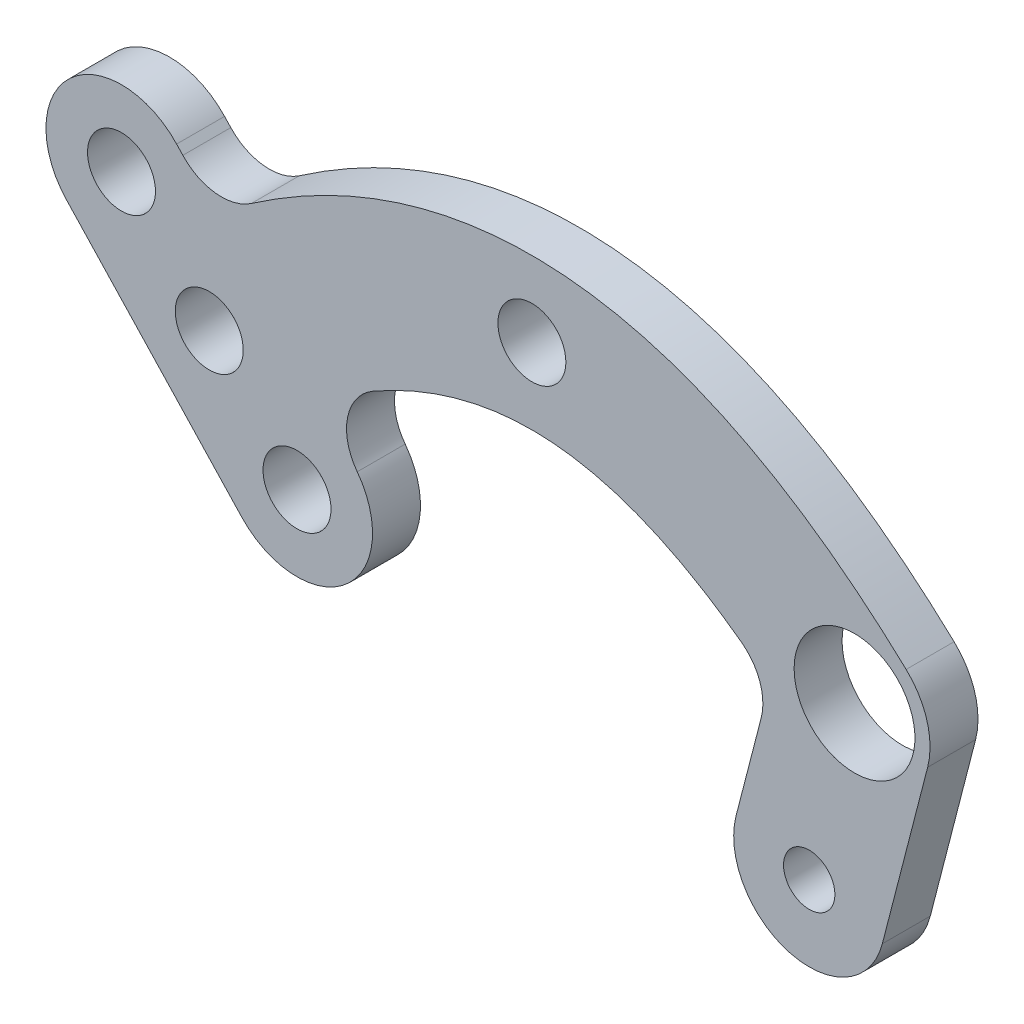
ISO-10303-21;
HEADER;
FILE_DESCRIPTION(('STEP AP214'),'2;1');
FILE_NAME('part.step','',(''),(''),'','','');
FILE_SCHEMA(('AUTOMOTIVE_DESIGN { 1 0 10303 214 1 1 1 1 }'));
ENDSEC;
DATA;
#1=APPLICATION_CONTEXT('core data for automotive mechanical design processes');
#2=APPLICATION_PROTOCOL_DEFINITION('international standard','automotive_design',2000,#1);
#3=PRODUCT_CONTEXT('',#1,'mechanical');
#4=PRODUCT('Part','Part','',(#3));
#5=PRODUCT_RELATED_PRODUCT_CATEGORY('part','',(#4));
#6=PRODUCT_DEFINITION_FORMATION('','',#4);
#7=PRODUCT_DEFINITION_CONTEXT('part definition',#1,'design');
#8=PRODUCT_DEFINITION('design','',#6,#7);
#9=PRODUCT_DEFINITION_SHAPE('','',#8);
#10=(LENGTH_UNIT() NAMED_UNIT(*) SI_UNIT(.MILLI.,.METRE.));
#11=(NAMED_UNIT(*) PLANE_ANGLE_UNIT() SI_UNIT($,.RADIAN.));
#12=(NAMED_UNIT(*) SI_UNIT($,.STERADIAN.) SOLID_ANGLE_UNIT());
#13=UNCERTAINTY_MEASURE_WITH_UNIT(LENGTH_MEASURE(1.E-05),#10,'distance_accuracy_value','');
#14=(GEOMETRIC_REPRESENTATION_CONTEXT(3) GLOBAL_UNCERTAINTY_ASSIGNED_CONTEXT((#13)) GLOBAL_UNIT_ASSIGNED_CONTEXT((#10,
#11,#12)) REPRESENTATION_CONTEXT('',''));
#15=CARTESIAN_POINT('',(0.,0.,0.));
#16=DIRECTION('',(0.,0.,1.));
#17=DIRECTION('',(1.,0.,0.));
#18=AXIS2_PLACEMENT_3D('',#15,#16,#17);
#19=CARTESIAN_POINT('',(-24.7774314290993,-6.35018323372195,1.5875));
#20=CARTESIAN_POINT('',(-24.2998102513977,-5.90297239317743,1.5875));
#21=CARTESIAN_POINT('',(-23.3228949597084,-5.01651392990913,1.5875));
#22=CARTESIAN_POINT('',(-21.3738810598693,-3.36280289341278,1.5875));
#23=CARTESIAN_POINT('',(-18.9018748021789,-1.48063302855797,1.5875));
#24=CARTESIAN_POINT('',(-15.8850966754007,0.462779531041348,1.5875));
#25=CARTESIAN_POINT('',(-11.7850099244528,2.6247446642725,1.5875));
#26=CARTESIAN_POINT('',(-6.5093751368029,4.4880889395126,1.5875));
#27=CARTESIAN_POINT('',(0.,5.2559555302437,1.5875));
#28=CARTESIAN_POINT('',(6.5093751368029,4.4880889395126,1.5875));
#29=CARTESIAN_POINT('',(11.7850099244528,2.62474466427251,1.5875));
#30=CARTESIAN_POINT('',(15.8850966754007,0.462779531041344,1.5875));
#31=CARTESIAN_POINT('',(18.9018748021789,-1.48063302855797,1.5875));
#32=CARTESIAN_POINT('',(21.3738810598693,-3.36280289341278,1.5875));
#33=CARTESIAN_POINT('',(23.3228949597084,-5.01651392990913,1.5875));
#34=CARTESIAN_POINT('',(24.2998102513977,-5.90297239317743,1.5875));
#35=CARTESIAN_POINT('',(24.7774314290993,-6.35018323372195,1.5875));
#36=B_SPLINE_CURVE_WITH_KNOTS('',3,(#19,#20,#21,#22,#23,#24,#25,#26,#27,#28,#29,#30,#31,#32,#33,
#34,#35),.UNSPECIFIED.,.F.,.F.,(4,1,1,1,1,1,1,1,1,1,1,1,1,1,4),(0.,0.03125,0.0625,0.125,0.1875,
0.25,0.375,0.5,0.625,0.75,0.8125,0.875,0.9375,0.96875,1.),.UNSPECIFIED.);
#37=DIRECTION('',(0.,0.,-1.));
#38=VECTOR('',#37,1.);
#39=SURFACE_OF_LINEAR_EXTRUSION('',#36,#38);
#40=CARTESIAN_POINT('',(-24.7774314290993,-6.35018323372195,-1.5875));
#41=CARTESIAN_POINT('',(-24.2998102513977,-5.90297239317743,-1.5875));
#42=CARTESIAN_POINT('',(-23.3228949597084,-5.01651392990913,-1.5875));
#43=CARTESIAN_POINT('',(-21.3738810598693,-3.36280289341278,-1.5875));
#44=CARTESIAN_POINT('',(-18.9018748021789,-1.48063302855797,-1.5875));
#45=CARTESIAN_POINT('',(-15.8850966754007,0.462779531041348,-1.5875));
#46=CARTESIAN_POINT('',(-11.7850099244528,2.6247446642725,-1.5875));
#47=CARTESIAN_POINT('',(-6.5093751368029,4.4880889395126,-1.5875));
#48=CARTESIAN_POINT('',(0.,5.2559555302437,-1.5875));
#49=CARTESIAN_POINT('',(6.5093751368029,4.4880889395126,-1.5875));
#50=CARTESIAN_POINT('',(11.7850099244528,2.62474466427251,-1.5875));
#51=CARTESIAN_POINT('',(15.8850966754007,0.462779531041344,-1.5875));
#52=CARTESIAN_POINT('',(18.9018748021789,-1.48063302855797,-1.5875));
#53=CARTESIAN_POINT('',(21.3738810598693,-3.36280289341278,-1.5875));
#54=CARTESIAN_POINT('',(23.3228949597084,-5.01651392990913,-1.5875));
#55=CARTESIAN_POINT('',(24.2998102513977,-5.90297239317743,-1.5875));
#56=CARTESIAN_POINT('',(24.7774314290993,-6.35018323372195,-1.5875));
#57=B_SPLINE_CURVE_WITH_KNOTS('',3,(#40,#41,#42,#43,#44,#45,#46,#47,#48,#49,#50,#51,#52,#53,#54,
#55,#56),.UNSPECIFIED.,.F.,.F.,(4,1,1,1,1,1,1,1,1,1,1,1,1,1,4),(0.,0.03125,0.0625,0.125,0.1875,
0.25,0.375,0.5,0.625,0.75,0.8125,0.875,0.9375,0.96875,1.),.UNSPECIFIED.);
#58=CARTESIAN_POINT('',(-18.5671163611911,-1.30604349272353,-1.5875));
#59=VERTEX_POINT('',#58);
#60=CARTESIAN_POINT('',(24.7774314290993,-6.35018323372195,-1.5875));
#61=VERTEX_POINT('',#60);
#62=EDGE_CURVE('E411',#59,#61,#57,.T.);
#63=ORIENTED_EDGE('',*,*,#62,.F.);
#64=DIRECTION('',(0.,0.,-1.));
#65=VECTOR('',#64,1.);
#66=CARTESIAN_POINT('',(-18.5671163611911,-1.30604349272352,-1.5875));
#67=LINE('',#66,#65);
#68=CARTESIAN_POINT('',(-18.5671163611911,-1.30604349272353,1.5875));
#69=VERTEX_POINT('',#68);
#70=EDGE_CURVE('E457',#59,#69,#67,.F.);
#71=ORIENTED_EDGE('',*,*,#70,.T.);
#72=CARTESIAN_POINT('',(24.7774314290993,-6.35018323372195,1.5875));
#73=VERTEX_POINT('',#72);
#74=EDGE_CURVE('E330',#69,#73,#36,.T.);
#75=ORIENTED_EDGE('',*,*,#74,.T.);
#76=DIRECTION('',(0.,0.,-1.));
#77=VECTOR('',#76,1.);
#78=CARTESIAN_POINT('',(24.7774314290993,-6.35018323372195,1.5875));
#79=LINE('',#78,#77);
#80=EDGE_CURVE('E406',#73,#61,#79,.T.);
#81=ORIENTED_EDGE('',*,*,#80,.T.);
#82=EDGE_LOOP('',(#63,#71,#75,#81));
#83=FACE_BOUND('',#82,.T.);
#84=ADVANCED_FACE('F177',(#83),#39,.T.);
#85=CARTESIAN_POINT('',(0.,0.,-1.5875));
#86=DIRECTION('',(0.,0.,1.));
#87=DIRECTION('',(1.,0.,0.));
#88=AXIS2_PLACEMENT_3D('',#85,#86,#87);
#89=PLANE('',#88);
#90=CARTESIAN_POINT('',(21.36,-10.,-1.5875));
#91=DIRECTION('',(0.,0.,-1.));
#92=DIRECTION('',(-1.,0.,0.));
#93=AXIS2_PLACEMENT_3D('',#90,#91,#92);
#94=CIRCLE('',#93,4.);
#95=CARTESIAN_POINT('',(17.36,-10.,-1.5875));
#96=VERTEX_POINT('',#95);
#97=EDGE_CURVE('E492',#96,#96,#94,.T.);
#98=ORIENTED_EDGE('',*,*,#97,.F.);
#99=EDGE_LOOP('',(#98));
#100=FACE_BOUND('',#99,.T.);
#101=CARTESIAN_POINT('',(18.36,-21.6189500386222,-1.5875));
#102=DIRECTION('',(0.,0.,-1.));
#103=DIRECTION('',(-1.,0.,0.));
#104=AXIS2_PLACEMENT_3D('',#101,#102,#103);
#105=CIRCLE('',#104,1.7);
#106=CARTESIAN_POINT('',(16.66,-21.6189500386222,-1.5875));
#107=VERTEX_POINT('',#106);
#108=EDGE_CURVE('E488',#107,#107,#105,.T.);
#109=ORIENTED_EDGE('',*,*,#108,.F.);
#110=EDGE_LOOP('',(#109));
#111=FACE_BOUND('',#110,.T.);
#112=DIRECTION('',(0.25,0.968245836551854,0.));
#113=VECTOR('',#112,1.);
#114=CARTESIAN_POINT('',(17.6043854086204,-4.5454327671869,-1.5875));
#115=LINE('',#114,#113);
#116=CARTESIAN_POINT('',(13.5187708172407,-20.3689500386223,-1.5875));
#117=VERTEX_POINT('',#116);
#118=CARTESIAN_POINT('',(15.181366688933,-13.9297439160849,-1.5875));
#119=VERTEX_POINT('',#118);
#120=EDGE_CURVE('E290',#117,#119,#115,.T.);
#121=ORIENTED_EDGE('',*,*,#120,.T.);
#122=CARTESIAN_POINT('',(11.7925062610015,-13.0547439160849,-1.5875));
#123=DIRECTION('',(0.,0.,1.));
#124=DIRECTION('',(1.,0.,0.));
#125=AXIS2_PLACEMENT_3D('',#122,#123,#124);
#126=CIRCLE('',#125,3.5);
#127=CARTESIAN_POINT('',(13.8714595418848,-10.239081781541,-1.5875));
#128=VERTEX_POINT('',#127);
#129=EDGE_CURVE('E185',#119,#128,#126,.T.);
#130=ORIENTED_EDGE('',*,*,#129,.T.);
#131=CARTESIAN_POINT('',(-17.9425685709007,-13.649816766278,-1.5875));
#132=CARTESIAN_POINT('',(-17.5430726857818,-13.275756948751,-1.5875));
#133=CARTESIAN_POINT('',(-16.7212792004638,-12.5301144959242,-1.5875));
#134=CARTESIAN_POINT('',(-15.1194822649109,-11.1715962935639,-1.5875));
#135=CARTESIAN_POINT('',(-13.1369844739387,-9.66413215948502,-1.5875));
#136=CARTESIAN_POINT('',(-10.8152020856161,-8.17139279210594,-1.5875));
#137=CARTESIAN_POINT('',(-7.79481806162839,-6.58291593418248,-1.5875));
#138=CARTESIAN_POINT('',(-4.17067918338198,-5.32148120499988,-1.5875));
#139=CARTESIAN_POINT('',(0.,-4.83925939750006,-1.5875));
#140=CARTESIAN_POINT('',(4.17067918338198,-5.32148120499988,-1.5875));
#141=CARTESIAN_POINT('',(7.79481806162839,-6.58291593418248,-1.5875));
#142=CARTESIAN_POINT('',(10.8152020856161,-8.17139279210594,-1.5875));
#143=CARTESIAN_POINT('',(13.1369844739387,-9.66413215948502,-1.5875));
#144=CARTESIAN_POINT('',(15.1194822649109,-11.1715962935639,-1.5875));
#145=CARTESIAN_POINT('',(16.7212792004638,-12.5301144959242,-1.5875));
#146=CARTESIAN_POINT('',(17.5430726857818,-13.275756948751,-1.5875));
#147=CARTESIAN_POINT('',(17.9425685709007,-13.649816766278,-1.5875));
#148=B_SPLINE_CURVE_WITH_KNOTS('',3,(#131,#132,#133,#134,#135,#136,#137,#138,#139,#140,#141,
#142,#143,#144,#145,#146,#147),.UNSPECIFIED.,.F.,.F.,(4,1,1,1,1,1,1,1,1,1,1,1,1,1,4),(0.,
0.03125,0.0625,0.125,0.1875,0.25,0.375,0.5,0.625,0.75,0.8125,0.875,0.9375,0.96875,1.),.UNSPECIFIED.);
#149=CARTESIAN_POINT('',(-10.5009094068875,-8.03488231582913,-1.5875));
#150=VERTEX_POINT('',#149);
#151=EDGE_CURVE('E415',#150,#128,#148,.T.);
#152=ORIENTED_EDGE('',*,*,#151,.F.);
#153=CARTESIAN_POINT('',(-8.77089976969667,-11.0774251101423,-1.5875));
#154=DIRECTION('',(0.,0.,1.));
#155=DIRECTION('',(1.,0.,0.));
#156=AXIS2_PLACEMENT_3D('',#153,#154,#155);
#157=CIRCLE('',#156,3.5);
#158=CARTESIAN_POINT('',(-11.5624449229815,-13.1886512129489,-1.5875));
#159=VERTEX_POINT('',#158);
#160=EDGE_CURVE('E472',#150,#159,#157,.T.);
#161=ORIENTED_EDGE('',*,*,#160,.T.);
#162=CARTESIAN_POINT('',(-15.5503665705312,-16.2046885026727,-1.5875));
#163=DIRECTION('',(0.,0.,-1.));
#164=DIRECTION('',(-1.,0.,0.));
#165=AXIS2_PLACEMENT_3D('',#162,#163,#164);
#166=CIRCLE('',#165,5.);
#167=CARTESIAN_POINT('',(-19.2001833368092,-19.622119931772,-1.5875));
#168=VERTEX_POINT('',#167);
#169=EDGE_CURVE('E329',#159,#168,#166,.T.);
#170=ORIENTED_EDGE('',*,*,#169,.T.);
#171=DIRECTION('',(-0.68348628581986,0.729963353255608,0.));
#172=VECTOR('',#171,1.);
#173=CARTESIAN_POINT('',(-28.4272481953773,-9.76761466282125,-1.5875));
#174=LINE('',#173,#172);
#175=CARTESIAN_POINT('',(-30.8194501957469,-7.21274292642662,-1.5875));
#176=VERTEX_POINT('',#175);
#177=EDGE_CURVE('E442',#168,#176,#174,.T.);
#178=ORIENTED_EDGE('',*,*,#177,.T.);
#179=CARTESIAN_POINT('',(-27.1696334294688,-3.79531149732732,-1.5875));
#180=DIRECTION('',(0.,0.,1.));
#181=DIRECTION('',(1.,0.,0.));
#182=AXIS2_PLACEMENT_3D('',#179,#180,#181);
#183=CIRCLE('',#182,5.);
#184=CARTESIAN_POINT('',(-23.5198166631908,-0.377880068228026,-1.5875));
#185=VERTEX_POINT('',#184);
#186=EDGE_CURVE('E444',#185,#176,#183,.T.);
#187=ORIENTED_EDGE('',*,*,#186,.F.);
#188=DIRECTION('',(-0.683486285819859,0.729963353255609,0.));
#189=VECTOR('',#188,1.);
#190=CARTESIAN_POINT('',(-21.1276146628213,-2.93275180462266,-1.5875));
#191=LINE('',#190,#189);
#192=CARTESIAN_POINT('',(-23.1088113192402,-0.816833775567268,-1.5875));
#193=VERTEX_POINT('',#192);
#194=EDGE_CURVE('E432',#193,#185,#191,.T.);
#195=ORIENTED_EDGE('',*,*,#194,.F.);
#196=CARTESIAN_POINT('',(-20.5539395828455,1.57536822480223,-1.5875));
#197=DIRECTION('',(0.,0.,1.));
#198=DIRECTION('',(1.,0.,0.));
#199=AXIS2_PLACEMENT_3D('',#196,#197,#198);
#200=CIRCLE('',#199,3.5);
#201=EDGE_CURVE('E468',#193,#59,#200,.T.);
#202=ORIENTED_EDGE('',*,*,#201,.T.);
#203=ORIENTED_EDGE('',*,*,#62,.T.);
#204=CARTESIAN_POINT('',(21.36,-10.,-1.5875));
#205=DIRECTION('',(0.,0.,1.));
#206=DIRECTION('',(1.,0.,0.));
#207=AXIS2_PLACEMENT_3D('',#204,#205,#206);
#208=CIRCLE('',#207,5.);
#209=CARTESIAN_POINT('',(26.2012291827593,-11.25,-1.5875));
#210=VERTEX_POINT('',#209);
#211=EDGE_CURVE('E336',#210,#61,#208,.T.);
#212=ORIENTED_EDGE('',*,*,#211,.F.);
#213=DIRECTION('',(0.25,0.968245836551854,0.));
#214=VECTOR('',#213,1.);
#215=CARTESIAN_POINT('',(27.2868437741389,-7.0454327671869,-1.5875));
#216=LINE('',#215,#214);
#217=CARTESIAN_POINT('',(23.2012291827593,-22.8689500386223,-1.5875));
#218=VERTEX_POINT('',#217);
#219=EDGE_CURVE('E281',#218,#210,#216,.T.);
#220=ORIENTED_EDGE('',*,*,#219,.F.);
#221=CARTESIAN_POINT('',(18.36,-21.6189500386222,-1.5875));
#222=DIRECTION('',(0.,0.,-1.));
#223=DIRECTION('',(-1.,0.,0.));
#224=AXIS2_PLACEMENT_3D('',#221,#222,#223);
#225=CIRCLE('',#224,5.);
#226=EDGE_CURVE('E278',#117,#218,#225,.F.);
#227=ORIENTED_EDGE('',*,*,#226,.F.);
#228=EDGE_LOOP('',(#121,#130,#152,#161,#170,#178,#187,#195,#202,#203,#212,#220,#227));
#229=FACE_BOUND('',#228,.T.);
#230=CARTESIAN_POINT('',(-21.3599999993473,-9.99999999938886,-1.5875));
#231=DIRECTION('',(0.,0.,1.));
#232=DIRECTION('',(1.,0.,0.));
#233=AXIS2_PLACEMENT_3D('',#230,#231,#232);
#234=CIRCLE('',#233,2.25);
#235=CARTESIAN_POINT('',(-19.1099999993473,-9.99999999938886,-1.5875));
#236=VERTEX_POINT('',#235);
#237=EDGE_CURVE('E299',#236,#236,#234,.T.);
#238=ORIENTED_EDGE('',*,*,#237,.T.);
#239=EDGE_LOOP('',(#238));
#240=FACE_BOUND('',#239,.T.);
#241=CARTESIAN_POINT('',(0.,0.,-1.5875));
#242=DIRECTION('',(0.,0.,1.));
#243=DIRECTION('',(1.,0.,0.));
#244=AXIS2_PLACEMENT_3D('',#241,#242,#243);
#245=CIRCLE('',#244,2.25);
#246=CARTESIAN_POINT('',(2.25,0.,-1.5875));
#247=VERTEX_POINT('',#246);
#248=EDGE_CURVE('E314',#247,#247,#245,.T.);
#249=ORIENTED_EDGE('',*,*,#248,.T.);
#250=EDGE_LOOP('',(#249));
#251=FACE_BOUND('',#250,.T.);
#252=CARTESIAN_POINT('',(-15.5503665705312,-16.2046885026727,-1.5875));
#253=DIRECTION('',(0.,0.,1.));
#254=DIRECTION('',(1.,0.,0.));
#255=AXIS2_PLACEMENT_3D('',#252,#253,#254);
#256=CIRCLE('',#255,2.25);
#257=CARTESIAN_POINT('',(-13.3003665705312,-16.2046885026727,-1.5875));
#258=VERTEX_POINT('',#257);
#259=EDGE_CURVE('E320',#258,#258,#256,.T.);
#260=ORIENTED_EDGE('',*,*,#259,.T.);
#261=EDGE_LOOP('',(#260));
#262=FACE_BOUND('',#261,.T.);
#263=CARTESIAN_POINT('',(-27.1696334294688,-3.79531149732732,-1.5875));
#264=DIRECTION('',(0.,0.,1.));
#265=DIRECTION('',(1.,0.,0.));
#266=AXIS2_PLACEMENT_3D('',#263,#264,#265);
#267=CIRCLE('',#266,2.25);
#268=CARTESIAN_POINT('',(-24.9196334294688,-3.79531149732732,-1.5875));
#269=VERTEX_POINT('',#268);
#270=EDGE_CURVE('E326',#269,#269,#267,.T.);
#271=ORIENTED_EDGE('',*,*,#270,.T.);
#272=EDGE_LOOP('',(#271));
#273=FACE_BOUND('',#272,.T.);
#274=ADVANCED_FACE('F348',(#100,#111,#229,#240,#251,#262,#273),#89,.F.);
#275=CARTESIAN_POINT('',(-17.9425685709007,-13.649816766278,1.5875));
#276=CARTESIAN_POINT('',(-17.5430726857818,-13.275756948751,1.5875));
#277=CARTESIAN_POINT('',(-16.7212792004638,-12.5301144959242,1.5875));
#278=CARTESIAN_POINT('',(-15.1194822649109,-11.1715962935639,1.5875));
#279=CARTESIAN_POINT('',(-13.1369844739387,-9.66413215948502,1.5875));
#280=CARTESIAN_POINT('',(-10.8152020856161,-8.17139279210594,1.5875));
#281=CARTESIAN_POINT('',(-7.79481806162839,-6.58291593418248,1.5875));
#282=CARTESIAN_POINT('',(-4.17067918338198,-5.32148120499988,1.5875));
#283=CARTESIAN_POINT('',(0.,-4.83925939750006,1.5875));
#284=CARTESIAN_POINT('',(4.17067918338198,-5.32148120499988,1.5875));
#285=CARTESIAN_POINT('',(7.79481806162839,-6.58291593418248,1.5875));
#286=CARTESIAN_POINT('',(10.8152020856161,-8.17139279210594,1.5875));
#287=CARTESIAN_POINT('',(13.1369844739387,-9.66413215948502,1.5875));
#288=CARTESIAN_POINT('',(15.1194822649109,-11.1715962935639,1.5875));
#289=CARTESIAN_POINT('',(16.7212792004638,-12.5301144959242,1.5875));
#290=CARTESIAN_POINT('',(17.5430726857818,-13.275756948751,1.5875));
#291=CARTESIAN_POINT('',(17.9425685709007,-13.649816766278,1.5875));
#292=B_SPLINE_CURVE_WITH_KNOTS('',3,(#275,#276,#277,#278,#279,#280,#281,#282,#283,#284,#285,
#286,#287,#288,#289,#290,#291),.UNSPECIFIED.,.F.,.F.,(4,1,1,1,1,1,1,1,1,1,1,1,1,1,4),(0.,
0.03125,0.0625,0.125,0.1875,0.25,0.375,0.5,0.625,0.75,0.8125,0.875,0.9375,0.96875,1.),.UNSPECIFIED.);
#293=DIRECTION('',(0.,0.,-1.));
#294=VECTOR('',#293,1.);
#295=SURFACE_OF_LINEAR_EXTRUSION('',#292,#294);
#296=CARTESIAN_POINT('',(-10.5009094068875,-8.03488231582913,1.5875));
#297=VERTEX_POINT('',#296);
#298=CARTESIAN_POINT('',(13.8714595418848,-10.239081781541,1.5875));
#299=VERTEX_POINT('',#298);
#300=EDGE_CURVE('E335',#297,#299,#292,.T.);
#301=ORIENTED_EDGE('',*,*,#300,.F.);
#302=DIRECTION('',(0.,0.,-1.));
#303=VECTOR('',#302,1.);
#304=CARTESIAN_POINT('',(-10.5009094068875,-8.03488231582913,1.5875));
#305=LINE('',#304,#303);
#306=EDGE_CURVE('E461',#297,#150,#305,.T.);
#307=ORIENTED_EDGE('',*,*,#306,.T.);
#308=ORIENTED_EDGE('',*,*,#151,.T.);
#309=DIRECTION('',(0.,0.,-1.));
#310=VECTOR('',#309,1.);
#311=CARTESIAN_POINT('',(13.8714595418848,-10.239081781541,-1.5875));
#312=LINE('',#311,#310);
#313=EDGE_CURVE('E459',#128,#299,#312,.F.);
#314=ORIENTED_EDGE('',*,*,#313,.T.);
#315=EDGE_LOOP('',(#301,#307,#308,#314));
#316=FACE_BOUND('',#315,.T.);
#317=ADVANCED_FACE('F350',(#316),#295,.F.);
#318=CARTESIAN_POINT('',(21.36,-10.,1.5875));
#319=DIRECTION('',(0.,0.,-1.));
#320=DIRECTION('',(-1.,0.,0.));
#321=AXIS2_PLACEMENT_3D('',#318,#319,#320);
#322=CYLINDRICAL_SURFACE('',#321,5.);
#323=CARTESIAN_POINT('',(21.36,-10.,1.5875));
#324=DIRECTION('',(0.,0.,1.));
#325=DIRECTION('',(1.,0.,0.));
#326=AXIS2_PLACEMENT_3D('',#323,#324,#325);
#327=CIRCLE('',#326,5.);
#328=CARTESIAN_POINT('',(26.2012291827593,-11.25,1.5875));
#329=VERTEX_POINT('',#328);
#330=EDGE_CURVE('E402',#329,#73,#327,.T.);
#331=ORIENTED_EDGE('',*,*,#330,.F.);
#332=DIRECTION('',(0.,0.,-1.));
#333=VECTOR('',#332,1.);
#334=CARTESIAN_POINT('',(26.2012291827593,-11.25,21.6150258635163));
#335=LINE('',#334,#333);
#336=EDGE_CURVE('E287',#329,#210,#335,.T.);
#337=ORIENTED_EDGE('',*,*,#336,.T.);
#338=ORIENTED_EDGE('',*,*,#211,.T.);
#339=ORIENTED_EDGE('',*,*,#80,.F.);
#340=EDGE_LOOP('',(#331,#337,#338,#339));
#341=FACE_BOUND('',#340,.T.);
#342=ADVANCED_FACE('F358',(#341),#322,.T.);
#343=CARTESIAN_POINT('',(0.,0.,1.5875));
#344=DIRECTION('',(0.,0.,1.));
#345=DIRECTION('',(1.,0.,0.));
#346=AXIS2_PLACEMENT_3D('',#343,#344,#345);
#347=PLANE('',#346);
#348=CARTESIAN_POINT('',(21.36,-10.,1.5875));
#349=DIRECTION('',(0.,0.,-1.));
#350=DIRECTION('',(-1.,0.,0.));
#351=AXIS2_PLACEMENT_3D('',#348,#349,#350);
#352=CIRCLE('',#351,4.);
#353=CARTESIAN_POINT('',(17.36,-10.,1.5875));
#354=VERTEX_POINT('',#353);
#355=EDGE_CURVE('E491',#354,#354,#352,.T.);
#356=ORIENTED_EDGE('',*,*,#355,.T.);
#357=EDGE_LOOP('',(#356));
#358=FACE_BOUND('',#357,.T.);
#359=CARTESIAN_POINT('',(18.36,-21.6189500386222,1.5875));
#360=DIRECTION('',(0.,0.,-1.));
#361=DIRECTION('',(-1.,0.,0.));
#362=AXIS2_PLACEMENT_3D('',#359,#360,#361);
#363=CIRCLE('',#362,1.7);
#364=CARTESIAN_POINT('',(16.66,-21.6189500386222,1.5875));
#365=VERTEX_POINT('',#364);
#366=EDGE_CURVE('E307',#365,#365,#363,.T.);
#367=ORIENTED_EDGE('',*,*,#366,.T.);
#368=EDGE_LOOP('',(#367));
#369=FACE_BOUND('',#368,.T.);
#370=CARTESIAN_POINT('',(-15.5503665705312,-16.2046885026727,1.5875));
#371=DIRECTION('',(0.,0.,-1.));
#372=DIRECTION('',(-1.,0.,0.));
#373=AXIS2_PLACEMENT_3D('',#370,#371,#372);
#374=CIRCLE('',#373,5.);
#375=CARTESIAN_POINT('',(-11.5624449229815,-13.1886512129489,1.5875));
#376=VERTEX_POINT('',#375);
#377=CARTESIAN_POINT('',(-19.2001833368092,-19.622119931772,1.5875));
#378=VERTEX_POINT('',#377);
#379=EDGE_CURVE('E431',#376,#378,#374,.T.);
#380=ORIENTED_EDGE('',*,*,#379,.F.);
#381=CARTESIAN_POINT('',(-8.77089976969667,-11.0774251101423,1.5875));
#382=DIRECTION('',(0.,0.,1.));
#383=DIRECTION('',(1.,0.,0.));
#384=AXIS2_PLACEMENT_3D('',#381,#382,#383);
#385=CIRCLE('',#384,3.5);
#386=EDGE_CURVE('E474',#376,#297,#385,.F.);
#387=ORIENTED_EDGE('',*,*,#386,.T.);
#388=ORIENTED_EDGE('',*,*,#300,.T.);
#389=CARTESIAN_POINT('',(11.7925062610015,-13.0547439160849,1.5875));
#390=DIRECTION('',(0.,0.,1.));
#391=DIRECTION('',(1.,0.,0.));
#392=AXIS2_PLACEMENT_3D('',#389,#390,#391);
#393=CIRCLE('',#392,3.5);
#394=CARTESIAN_POINT('',(15.181366688933,-13.9297439160849,1.5875));
#395=VERTEX_POINT('',#394);
#396=EDGE_CURVE('E12',#299,#395,#393,.F.);
#397=ORIENTED_EDGE('',*,*,#396,.T.);
#398=DIRECTION('',(0.25,0.968245836551854,0.));
#399=VECTOR('',#398,1.);
#400=CARTESIAN_POINT('',(17.6043854086204,-4.5454327671869,1.5875));
#401=LINE('',#400,#399);
#402=CARTESIAN_POINT('',(13.5187708172407,-20.3689500386223,1.5875));
#403=VERTEX_POINT('',#402);
#404=EDGE_CURVE('E295',#403,#395,#401,.T.);
#405=ORIENTED_EDGE('',*,*,#404,.F.);
#406=CARTESIAN_POINT('',(18.36,-21.6189500386222,1.5875));
#407=DIRECTION('',(0.,0.,1.));
#408=DIRECTION('',(1.,0.,0.));
#409=AXIS2_PLACEMENT_3D('',#406,#407,#408);
#410=CIRCLE('',#409,5.);
#411=CARTESIAN_POINT('',(23.2012291827593,-22.8689500386223,1.5875));
#412=VERTEX_POINT('',#411);
#413=EDGE_CURVE('E275',#403,#412,#410,.T.);
#414=ORIENTED_EDGE('',*,*,#413,.T.);
#415=DIRECTION('',(0.25,0.968245836551854,0.));
#416=VECTOR('',#415,1.);
#417=CARTESIAN_POINT('',(27.2868437741389,-7.0454327671869,1.5875));
#418=LINE('',#417,#416);
#419=EDGE_CURVE('E284',#412,#329,#418,.T.);
#420=ORIENTED_EDGE('',*,*,#419,.T.);
#421=ORIENTED_EDGE('',*,*,#330,.T.);
#422=ORIENTED_EDGE('',*,*,#74,.F.);
#423=CARTESIAN_POINT('',(-20.5539395828455,1.57536822480223,1.5875));
#424=DIRECTION('',(0.,0.,1.));
#425=DIRECTION('',(1.,0.,0.));
#426=AXIS2_PLACEMENT_3D('',#423,#424,#425);
#427=CIRCLE('',#426,3.5);
#428=CARTESIAN_POINT('',(-23.1088113192402,-0.816833775567268,1.5875));
#429=VERTEX_POINT('',#428);
#430=EDGE_CURVE('E470',#69,#429,#427,.F.);
#431=ORIENTED_EDGE('',*,*,#430,.T.);
#432=DIRECTION('',(0.68348628581986,-0.729963353255609,0.));
#433=VECTOR('',#432,1.);
#434=CARTESIAN_POINT('',(-21.1276146628213,-2.93275180462266,1.5875));
#435=LINE('',#434,#433);
#436=CARTESIAN_POINT('',(-23.5198166631908,-0.377880068228026,1.5875));
#437=VERTEX_POINT('',#436);
#438=EDGE_CURVE('E428',#437,#429,#435,.T.);
#439=ORIENTED_EDGE('',*,*,#438,.F.);
#440=CARTESIAN_POINT('',(-27.1696334294688,-3.79531149732732,1.5875));
#441=DIRECTION('',(0.,0.,1.));
#442=DIRECTION('',(1.,0.,0.));
#443=AXIS2_PLACEMENT_3D('',#440,#441,#442);
#444=CIRCLE('',#443,5.);
#445=CARTESIAN_POINT('',(-30.8194501957469,-7.21274292642662,1.5875));
#446=VERTEX_POINT('',#445);
#447=EDGE_CURVE('E437',#437,#446,#444,.T.);
#448=ORIENTED_EDGE('',*,*,#447,.T.);
#449=DIRECTION('',(0.68348628581986,-0.729963353255609,0.));
#450=VECTOR('',#449,1.);
#451=CARTESIAN_POINT('',(-21.5923853371787,-17.0672481953773,1.5875));
#452=LINE('',#451,#450);
#453=EDGE_CURVE('E434',#446,#378,#452,.T.);
#454=ORIENTED_EDGE('',*,*,#453,.T.);
#455=EDGE_LOOP('',(#380,#387,#388,#397,#405,#414,#420,#421,#422,#431,#439,#448,#454));
#456=FACE_BOUND('',#455,.T.);
#457=CARTESIAN_POINT('',(-21.3599999993473,-9.99999999938886,1.5875));
#458=DIRECTION('',(0.,0.,1.));
#459=DIRECTION('',(1.,0.,0.));
#460=AXIS2_PLACEMENT_3D('',#457,#458,#459);
#461=CIRCLE('',#460,2.24999999999999);
#462=CARTESIAN_POINT('',(-19.1099999993473,-9.99999999938886,1.5875));
#463=VERTEX_POINT('',#462);
#464=EDGE_CURVE('E296',#463,#463,#461,.T.);
#465=ORIENTED_EDGE('',*,*,#464,.F.);
#466=EDGE_LOOP('',(#465));
#467=FACE_BOUND('',#466,.T.);
#468=CARTESIAN_POINT('',(0.,0.,1.5875));
#469=DIRECTION('',(0.,0.,1.));
#470=DIRECTION('',(1.,0.,0.));
#471=AXIS2_PLACEMENT_3D('',#468,#469,#470);
#472=CIRCLE('',#471,2.24999999999999);
#473=CARTESIAN_POINT('',(2.24999999999999,0.,1.5875));
#474=VERTEX_POINT('',#473);
#475=EDGE_CURVE('E311',#474,#474,#472,.T.);
#476=ORIENTED_EDGE('',*,*,#475,.F.);
#477=EDGE_LOOP('',(#476));
#478=FACE_BOUND('',#477,.T.);
#479=CARTESIAN_POINT('',(-15.5503665705312,-16.2046885026727,1.5875));
#480=DIRECTION('',(0.,0.,1.));
#481=DIRECTION('',(1.,0.,0.));
#482=AXIS2_PLACEMENT_3D('',#479,#480,#481);
#483=CIRCLE('',#482,2.24999999999999);
#484=CARTESIAN_POINT('',(-13.3003665705312,-16.2046885026727,1.5875));
#485=VERTEX_POINT('',#484);
#486=EDGE_CURVE('E317',#485,#485,#483,.T.);
#487=ORIENTED_EDGE('',*,*,#486,.F.);
#488=EDGE_LOOP('',(#487));
#489=FACE_BOUND('',#488,.T.);
#490=CARTESIAN_POINT('',(-27.1696334294688,-3.79531149732732,1.5875));
#491=DIRECTION('',(0.,0.,1.));
#492=DIRECTION('',(1.,0.,0.));
#493=AXIS2_PLACEMENT_3D('',#490,#491,#492);
#494=CIRCLE('',#493,2.24999999999999);
#495=CARTESIAN_POINT('',(-24.9196334294688,-3.79531149732732,1.5875));
#496=VERTEX_POINT('',#495);
#497=EDGE_CURVE('E323',#496,#496,#494,.T.);
#498=ORIENTED_EDGE('',*,*,#497,.F.);
#499=EDGE_LOOP('',(#498));
#500=FACE_BOUND('',#499,.T.);
#501=ADVANCED_FACE('F293',(#358,#369,#456,#467,#478,#489,#500),#347,.T.);
#502=CARTESIAN_POINT('',(-28.4272481953773,-9.76761466282125,1.5875));
#503=DIRECTION('',(-0.729963353255608,-0.68348628581986,0.));
#504=DIRECTION('',(0.68348628581986,-0.729963353255608,0.));
#505=AXIS2_PLACEMENT_3D('',#502,#503,#504);
#506=PLANE('',#505);
#507=DIRECTION('',(0.,0.,-1.));
#508=VECTOR('',#507,1.);
#509=CARTESIAN_POINT('',(-30.8194501957469,-7.21274292642662,1.5875));
#510=LINE('',#509,#508);
#511=EDGE_CURVE('E450',#446,#176,#510,.T.);
#512=ORIENTED_EDGE('',*,*,#511,.T.);
#513=ORIENTED_EDGE('',*,*,#177,.F.);
#514=DIRECTION('',(0.,0.,-1.));
#515=VECTOR('',#514,1.);
#516=CARTESIAN_POINT('',(-19.2001833368092,-19.622119931772,1.5875));
#517=LINE('',#516,#515);
#518=EDGE_CURVE('E440',#378,#168,#517,.T.);
#519=ORIENTED_EDGE('',*,*,#518,.F.);
#520=ORIENTED_EDGE('',*,*,#453,.F.);
#521=EDGE_LOOP('',(#512,#513,#519,#520));
#522=FACE_BOUND('',#521,.T.);
#523=ADVANCED_FACE('F362',(#522),#506,.T.);
#524=CARTESIAN_POINT('',(-27.1696334294688,-3.79531149732732,1.5875));
#525=DIRECTION('',(0.,0.,-1.));
#526=DIRECTION('',(-1.,0.,0.));
#527=AXIS2_PLACEMENT_3D('',#524,#525,#526);
#528=CYLINDRICAL_SURFACE('',#527,5.);
#529=ORIENTED_EDGE('',*,*,#186,.T.);
#530=ORIENTED_EDGE('',*,*,#511,.F.);
#531=ORIENTED_EDGE('',*,*,#447,.F.);
#532=DIRECTION('',(0.,0.,-1.));
#533=VECTOR('',#532,1.);
#534=CARTESIAN_POINT('',(-23.5198166631908,-0.377880068228026,1.5875));
#535=LINE('',#534,#533);
#536=EDGE_CURVE('E416',#437,#185,#535,.T.);
#537=ORIENTED_EDGE('',*,*,#536,.T.);
#538=EDGE_LOOP('',(#529,#530,#531,#537));
#539=FACE_BOUND('',#538,.T.);
#540=ADVANCED_FACE('F359',(#539),#528,.T.);
#541=CARTESIAN_POINT('',(-15.5503665705312,-16.2046885026727,1.5875));
#542=DIRECTION('',(0.,0.,-1.));
#543=DIRECTION('',(-1.,0.,0.));
#544=AXIS2_PLACEMENT_3D('',#541,#542,#543);
#545=CYLINDRICAL_SURFACE('',#544,5.);
#546=ORIENTED_EDGE('',*,*,#169,.F.);
#547=DIRECTION('',(0.,0.,-1.));
#548=VECTOR('',#547,1.);
#549=CARTESIAN_POINT('',(-11.5624449229815,-13.1886512129489,1.5875));
#550=LINE('',#549,#548);
#551=EDGE_CURVE('E464',#159,#376,#550,.F.);
#552=ORIENTED_EDGE('',*,*,#551,.T.);
#553=ORIENTED_EDGE('',*,*,#379,.T.);
#554=ORIENTED_EDGE('',*,*,#518,.T.);
#555=EDGE_LOOP('',(#546,#552,#553,#554));
#556=FACE_BOUND('',#555,.T.);
#557=ADVANCED_FACE('F356',(#556),#545,.T.);
#558=CARTESIAN_POINT('',(-21.1276146628213,-2.93275180462266,1.5875));
#559=DIRECTION('',(-0.729963353255609,-0.683486285819859,0.));
#560=DIRECTION('',(0.683486285819859,-0.729963353255609,0.));
#561=AXIS2_PLACEMENT_3D('',#558,#559,#560);
#562=PLANE('',#561);
#563=ORIENTED_EDGE('',*,*,#438,.T.);
#564=DIRECTION('',(0.,0.,-1.));
#565=VECTOR('',#564,1.);
#566=CARTESIAN_POINT('',(-23.1088113192402,-0.816833775567268,1.5875));
#567=LINE('',#566,#565);
#568=EDGE_CURVE('E408',#429,#193,#567,.T.);
#569=ORIENTED_EDGE('',*,*,#568,.T.);
#570=ORIENTED_EDGE('',*,*,#194,.T.);
#571=ORIENTED_EDGE('',*,*,#536,.F.);
#572=EDGE_LOOP('',(#563,#569,#570,#571));
#573=FACE_BOUND('',#572,.T.);
#574=ADVANCED_FACE('F352',(#573),#562,.F.);
#575=CARTESIAN_POINT('',(-27.1696334294688,-3.79531149732732,1.5875));
#576=DIRECTION('',(0.,0.,1.));
#577=DIRECTION('',(1.,0.,0.));
#578=AXIS2_PLACEMENT_3D('',#575,#576,#577);
#579=CYLINDRICAL_SURFACE('',#578,2.24999999999999);
#580=ORIENTED_EDGE('',*,*,#270,.F.);
#581=EDGE_LOOP('',(#580));
#582=FACE_BOUND('',#581,.T.);
#583=ORIENTED_EDGE('',*,*,#497,.T.);
#584=EDGE_LOOP('',(#583));
#585=FACE_BOUND('',#584,.T.);
#586=ADVANCED_FACE('F355',(#582,#585),#579,.F.);
#587=CARTESIAN_POINT('',(-15.5503665705312,-16.2046885026727,1.5875));
#588=DIRECTION('',(0.,0.,1.));
#589=DIRECTION('',(1.,0.,0.));
#590=AXIS2_PLACEMENT_3D('',#587,#588,#589);
#591=CYLINDRICAL_SURFACE('',#590,2.24999999999999);
#592=ORIENTED_EDGE('',*,*,#259,.F.);
#593=EDGE_LOOP('',(#592));
#594=FACE_BOUND('',#593,.T.);
#595=ORIENTED_EDGE('',*,*,#486,.T.);
#596=EDGE_LOOP('',(#595));
#597=FACE_BOUND('',#596,.T.);
#598=ADVANCED_FACE('F519',(#594,#597),#591,.F.);
#599=CARTESIAN_POINT('',(0.,0.,1.5875));
#600=DIRECTION('',(0.,0.,1.));
#601=DIRECTION('',(1.,0.,0.));
#602=AXIS2_PLACEMENT_3D('',#599,#600,#601);
#603=CYLINDRICAL_SURFACE('',#602,2.24999999999999);
#604=ORIENTED_EDGE('',*,*,#248,.F.);
#605=EDGE_LOOP('',(#604));
#606=FACE_BOUND('',#605,.T.);
#607=ORIENTED_EDGE('',*,*,#475,.T.);
#608=EDGE_LOOP('',(#607));
#609=FACE_BOUND('',#608,.T.);
#610=ADVANCED_FACE('F515',(#606,#609),#603,.F.);
#611=CARTESIAN_POINT('',(-21.3599999993473,-9.99999999938886,1.5875));
#612=DIRECTION('',(0.,0.,1.));
#613=DIRECTION('',(1.,0.,0.));
#614=AXIS2_PLACEMENT_3D('',#611,#612,#613);
#615=CYLINDRICAL_SURFACE('',#614,2.24999999999999);
#616=ORIENTED_EDGE('',*,*,#237,.F.);
#617=EDGE_LOOP('',(#616));
#618=FACE_BOUND('',#617,.T.);
#619=ORIENTED_EDGE('',*,*,#464,.T.);
#620=EDGE_LOOP('',(#619));
#621=FACE_BOUND('',#620,.T.);
#622=ADVANCED_FACE('F513',(#618,#621),#615,.F.);
#623=CARTESIAN_POINT('',(17.6043854086204,-4.5454327671869,21.6150258635163));
#624=DIRECTION('',(-0.968245836551854,0.25,0.));
#625=DIRECTION('',(-0.25,-0.968245836551854,0.));
#626=AXIS2_PLACEMENT_3D('',#623,#624,#625);
#627=PLANE('',#626);
#628=ORIENTED_EDGE('',*,*,#404,.T.);
#629=DIRECTION('',(0.,0.,-1.));
#630=VECTOR('',#629,1.);
#631=CARTESIAN_POINT('',(15.181366688933,-13.9297439160849,21.6150258635163));
#632=LINE('',#631,#630);
#633=EDGE_CURVE('E466',#395,#119,#632,.T.);
#634=ORIENTED_EDGE('',*,*,#633,.T.);
#635=ORIENTED_EDGE('',*,*,#120,.F.);
#636=DIRECTION('',(0.,0.,-1.));
#637=VECTOR('',#636,1.);
#638=CARTESIAN_POINT('',(13.5187708172407,-20.3689500386223,21.6150258635163));
#639=LINE('',#638,#637);
#640=EDGE_CURVE('E304',#403,#117,#639,.T.);
#641=ORIENTED_EDGE('',*,*,#640,.F.);
#642=EDGE_LOOP('',(#628,#634,#635,#641));
#643=FACE_BOUND('',#642,.T.);
#644=ADVANCED_FACE('F483',(#643),#627,.T.);
#645=CARTESIAN_POINT('',(18.36,-21.6189500386222,21.6150258635163));
#646=DIRECTION('',(0.,0.,-1.));
#647=DIRECTION('',(-1.,0.,0.));
#648=AXIS2_PLACEMENT_3D('',#645,#646,#647);
#649=CYLINDRICAL_SURFACE('',#648,5.);
#650=ORIENTED_EDGE('',*,*,#413,.F.);
#651=ORIENTED_EDGE('',*,*,#640,.T.);
#652=ORIENTED_EDGE('',*,*,#226,.T.);
#653=DIRECTION('',(0.,0.,-1.));
#654=VECTOR('',#653,1.);
#655=CARTESIAN_POINT('',(23.2012291827593,-22.8689500386223,21.6150258635163));
#656=LINE('',#655,#654);
#657=EDGE_CURVE('E271',#412,#218,#656,.T.);
#658=ORIENTED_EDGE('',*,*,#657,.F.);
#659=EDGE_LOOP('',(#650,#651,#652,#658));
#660=FACE_BOUND('',#659,.T.);
#661=ADVANCED_FACE('F273',(#660),#649,.T.);
#662=CARTESIAN_POINT('',(27.2868437741389,-7.0454327671869,21.6150258635163));
#663=DIRECTION('',(-0.968245836551854,0.25,0.));
#664=DIRECTION('',(-0.25,-0.968245836551854,0.));
#665=AXIS2_PLACEMENT_3D('',#662,#663,#664);
#666=PLANE('',#665);
#667=ORIENTED_EDGE('',*,*,#419,.F.);
#668=ORIENTED_EDGE('',*,*,#657,.T.);
#669=ORIENTED_EDGE('',*,*,#219,.T.);
#670=ORIENTED_EDGE('',*,*,#336,.F.);
#671=EDGE_LOOP('',(#667,#668,#669,#670));
#672=FACE_BOUND('',#671,.T.);
#673=ADVANCED_FACE('F285',(#672),#666,.F.);
#674=CARTESIAN_POINT('',(18.36,-21.6189500386222,-1.5875));
#675=DIRECTION('',(0.,0.,-1.));
#676=DIRECTION('',(-1.,0.,0.));
#677=AXIS2_PLACEMENT_3D('',#674,#675,#676);
#678=CYLINDRICAL_SURFACE('',#677,1.7);
#679=ORIENTED_EDGE('',*,*,#366,.F.);
#680=EDGE_LOOP('',(#679));
#681=FACE_BOUND('',#680,.T.);
#682=ORIENTED_EDGE('',*,*,#108,.T.);
#683=EDGE_LOOP('',(#682));
#684=FACE_BOUND('',#683,.T.);
#685=ADVANCED_FACE('F373',(#681,#684),#678,.F.);
#686=CARTESIAN_POINT('',(-20.5539395828455,1.57536822480223,0.));
#687=DIRECTION('',(0.,0.,-1.));
#688=DIRECTION('',(-1.,0.,0.));
#689=AXIS2_PLACEMENT_3D('',#686,#687,#688);
#690=CYLINDRICAL_SURFACE('',#689,3.5);
#691=ORIENTED_EDGE('',*,*,#430,.F.);
#692=ORIENTED_EDGE('',*,*,#70,.F.);
#693=ORIENTED_EDGE('',*,*,#201,.F.);
#694=ORIENTED_EDGE('',*,*,#568,.F.);
#695=EDGE_LOOP('',(#691,#692,#693,#694));
#696=FACE_BOUND('',#695,.T.);
#697=ADVANCED_FACE('F370',(#696),#690,.F.);
#698=CARTESIAN_POINT('',(-8.77089976969667,-11.0774251101423,0.));
#699=DIRECTION('',(0.,0.,-1.));
#700=DIRECTION('',(-1.,0.,0.));
#701=AXIS2_PLACEMENT_3D('',#698,#699,#700);
#702=CYLINDRICAL_SURFACE('',#701,3.5);
#703=ORIENTED_EDGE('',*,*,#386,.F.);
#704=ORIENTED_EDGE('',*,*,#551,.F.);
#705=ORIENTED_EDGE('',*,*,#160,.F.);
#706=ORIENTED_EDGE('',*,*,#306,.F.);
#707=EDGE_LOOP('',(#703,#704,#705,#706));
#708=FACE_BOUND('',#707,.T.);
#709=ADVANCED_FACE('F372',(#708),#702,.F.);
#710=CARTESIAN_POINT('',(11.7925062610015,-13.0547439160849,0.));
#711=DIRECTION('',(0.,0.,-1.));
#712=DIRECTION('',(-1.,0.,0.));
#713=AXIS2_PLACEMENT_3D('',#710,#711,#712);
#714=CYLINDRICAL_SURFACE('',#713,3.5);
#715=ORIENTED_EDGE('',*,*,#396,.F.);
#716=ORIENTED_EDGE('',*,*,#313,.F.);
#717=ORIENTED_EDGE('',*,*,#129,.F.);
#718=ORIENTED_EDGE('',*,*,#633,.F.);
#719=EDGE_LOOP('',(#715,#716,#717,#718));
#720=FACE_BOUND('',#719,.T.);
#721=ADVANCED_FACE('F179',(#720),#714,.F.);
#722=CARTESIAN_POINT('',(21.36,-10.,1.5875));
#723=DIRECTION('',(0.,0.,-1.));
#724=DIRECTION('',(-1.,0.,0.));
#725=AXIS2_PLACEMENT_3D('',#722,#723,#724);
#726=CYLINDRICAL_SURFACE('',#725,4.);
#727=ORIENTED_EDGE('',*,*,#355,.F.);
#728=EDGE_LOOP('',(#727));
#729=FACE_BOUND('',#728,.T.);
#730=ORIENTED_EDGE('',*,*,#97,.T.);
#731=EDGE_LOOP('',(#730));
#732=FACE_BOUND('',#731,.T.);
#733=ADVANCED_FACE('F380',(#729,#732),#726,.F.);
#734=CLOSED_SHELL('',(#84,#274,#317,#342,#501,#523,#540,#557,#574,#586,#598,#610,#622,#644,#661,
#673,#685,#697,#709,#721,#733));
#735=MANIFOLD_SOLID_BREP('B2',#734);
#736=ADVANCED_BREP_SHAPE_REPRESENTATION('',(#18,#735),#14);
#737=SHAPE_DEFINITION_REPRESENTATION(#9,#736);
ENDSEC;
END-ISO-10303-21;
